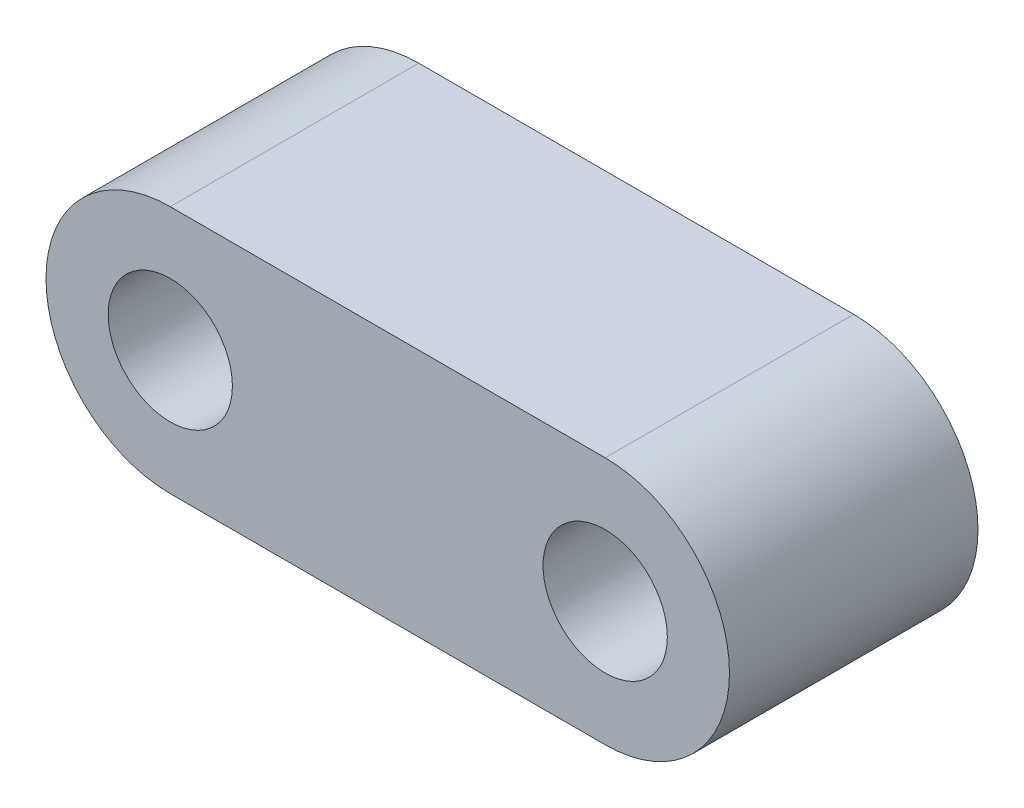
ISO-10303-21;
HEADER;
FILE_DESCRIPTION(('STEP AP214'),'2;1');
FILE_NAME('part.step','',(''),(''),'','','');
FILE_SCHEMA(('AUTOMOTIVE_DESIGN { 1 0 10303 214 1 1 1 1 }'));
ENDSEC;
DATA;
#1=APPLICATION_CONTEXT('core data for automotive mechanical design processes');
#2=APPLICATION_PROTOCOL_DEFINITION('international standard','automotive_design',2000,#1);
#3=PRODUCT_CONTEXT('',#1,'mechanical');
#4=PRODUCT('Part','Part','',(#3));
#5=PRODUCT_RELATED_PRODUCT_CATEGORY('part','',(#4));
#6=PRODUCT_DEFINITION_FORMATION('','',#4);
#7=PRODUCT_DEFINITION_CONTEXT('part definition',#1,'design');
#8=PRODUCT_DEFINITION('design','',#6,#7);
#9=PRODUCT_DEFINITION_SHAPE('','',#8);
#10=(LENGTH_UNIT() NAMED_UNIT(*) SI_UNIT(.MILLI.,.METRE.));
#11=(NAMED_UNIT(*) PLANE_ANGLE_UNIT() SI_UNIT($,.RADIAN.));
#12=(NAMED_UNIT(*) SI_UNIT($,.STERADIAN.) SOLID_ANGLE_UNIT());
#13=UNCERTAINTY_MEASURE_WITH_UNIT(LENGTH_MEASURE(1.E-05),#10,'distance_accuracy_value','');
#14=(GEOMETRIC_REPRESENTATION_CONTEXT(3) GLOBAL_UNCERTAINTY_ASSIGNED_CONTEXT((#13)) GLOBAL_UNIT_ASSIGNED_CONTEXT((#10,
#11,#12)) REPRESENTATION_CONTEXT('',''));
#15=CARTESIAN_POINT('',(0.,0.,0.));
#16=DIRECTION('',(0.,0.,1.));
#17=DIRECTION('',(1.,0.,0.));
#18=AXIS2_PLACEMENT_3D('',#15,#16,#17);
#19=CARTESIAN_POINT('',(0.,-20.,20.));
#20=DIRECTION('',(0.,-1.,0.));
#21=DIRECTION('',(0.,0.,-1.));
#22=AXIS2_PLACEMENT_3D('',#19,#20,#21);
#23=PLANE('',#22);
#24=DIRECTION('',(-1.,0.,0.));
#25=VECTOR('',#24,1.);
#26=CARTESIAN_POINT('',(0.,-20.,-20.));
#27=LINE('',#26,#25);
#28=CARTESIAN_POINT('',(70.,-20.,-20.));
#29=VERTEX_POINT('',#28);
#30=CARTESIAN_POINT('',(0.,-20.,-20.));
#31=VERTEX_POINT('',#30);
#32=EDGE_CURVE('E105',#29,#31,#27,.T.);
#33=ORIENTED_EDGE('',*,*,#32,.F.);
#34=DIRECTION('',(0.,0.,-1.));
#35=VECTOR('',#34,1.);
#36=CARTESIAN_POINT('',(70.,-20.,20.));
#37=LINE('',#36,#35);
#38=CARTESIAN_POINT('',(70.,-20.,20.));
#39=VERTEX_POINT('',#38);
#40=EDGE_CURVE('E11',#39,#29,#37,.T.);
#41=ORIENTED_EDGE('',*,*,#40,.F.);
#42=DIRECTION('',(-1.,0.,0.));
#43=VECTOR('',#42,1.);
#44=CARTESIAN_POINT('',(0.,-20.,20.));
#45=LINE('',#44,#43);
#46=CARTESIAN_POINT('',(0.,-20.,20.));
#47=VERTEX_POINT('',#46);
#48=EDGE_CURVE('E84',#39,#47,#45,.T.);
#49=ORIENTED_EDGE('',*,*,#48,.T.);
#50=DIRECTION('',(0.,0.,-1.));
#51=VECTOR('',#50,1.);
#52=CARTESIAN_POINT('',(0.,-20.,20.));
#53=LINE('',#52,#51);
#54=EDGE_CURVE('E73',#47,#31,#53,.T.);
#55=ORIENTED_EDGE('',*,*,#54,.T.);
#56=EDGE_LOOP('',(#33,#41,#49,#55));
#57=FACE_BOUND('',#56,.T.);
#58=ADVANCED_FACE('F35',(#57),#23,.T.);
#59=CARTESIAN_POINT('',(70.,0.,20.));
#60=DIRECTION('',(0.,0.,-1.));
#61=DIRECTION('',(-1.,0.,0.));
#62=AXIS2_PLACEMENT_3D('',#59,#60,#61);
#63=CYLINDRICAL_SURFACE('',#62,20.);
#64=CARTESIAN_POINT('',(70.,0.,-20.));
#65=DIRECTION('',(0.,0.,1.));
#66=DIRECTION('',(1.,0.,0.));
#67=AXIS2_PLACEMENT_3D('',#64,#65,#66);
#68=CIRCLE('',#67,20.);
#69=CARTESIAN_POINT('',(70.,20.,-20.));
#70=VERTEX_POINT('',#69);
#71=EDGE_CURVE('E90',#29,#70,#68,.T.);
#72=ORIENTED_EDGE('',*,*,#71,.T.);
#73=DIRECTION('',(0.,0.,-1.));
#74=VECTOR('',#73,1.);
#75=CARTESIAN_POINT('',(70.,20.,20.));
#76=LINE('',#75,#74);
#77=CARTESIAN_POINT('',(70.,20.,20.));
#78=VERTEX_POINT('',#77);
#79=EDGE_CURVE('E43',#78,#70,#76,.T.);
#80=ORIENTED_EDGE('',*,*,#79,.F.);
#81=CARTESIAN_POINT('',(70.,0.,20.));
#82=DIRECTION('',(0.,0.,1.));
#83=DIRECTION('',(1.,0.,0.));
#84=AXIS2_PLACEMENT_3D('',#81,#82,#83);
#85=CIRCLE('',#84,20.);
#86=EDGE_CURVE('E78',#39,#78,#85,.T.);
#87=ORIENTED_EDGE('',*,*,#86,.F.);
#88=ORIENTED_EDGE('',*,*,#40,.T.);
#89=EDGE_LOOP('',(#72,#80,#87,#88));
#90=FACE_BOUND('',#89,.T.);
#91=ADVANCED_FACE('F88',(#90),#63,.T.);
#92=CARTESIAN_POINT('',(0.,20.,20.));
#93=DIRECTION('',(0.,1.,0.));
#94=DIRECTION('',(0.,0.,1.));
#95=AXIS2_PLACEMENT_3D('',#92,#93,#94);
#96=PLANE('',#95);
#97=DIRECTION('',(1.,0.,0.));
#98=VECTOR('',#97,1.);
#99=CARTESIAN_POINT('',(0.,20.,-20.));
#100=LINE('',#99,#98);
#101=CARTESIAN_POINT('',(0.,20.,-20.));
#102=VERTEX_POINT('',#101);
#103=EDGE_CURVE('E109',#102,#70,#100,.T.);
#104=ORIENTED_EDGE('',*,*,#103,.F.);
#105=DIRECTION('',(0.,0.,-1.));
#106=VECTOR('',#105,1.);
#107=CARTESIAN_POINT('',(0.,20.,20.));
#108=LINE('',#107,#106);
#109=CARTESIAN_POINT('',(0.,20.,20.));
#110=VERTEX_POINT('',#109);
#111=EDGE_CURVE('E66',#110,#102,#108,.T.);
#112=ORIENTED_EDGE('',*,*,#111,.F.);
#113=DIRECTION('',(1.,0.,0.));
#114=VECTOR('',#113,1.);
#115=CARTESIAN_POINT('',(0.,20.,20.));
#116=LINE('',#115,#114);
#117=EDGE_CURVE('E83',#110,#78,#116,.T.);
#118=ORIENTED_EDGE('',*,*,#117,.T.);
#119=ORIENTED_EDGE('',*,*,#79,.T.);
#120=EDGE_LOOP('',(#104,#112,#118,#119));
#121=FACE_BOUND('',#120,.T.);
#122=ADVANCED_FACE('F94',(#121),#96,.T.);
#123=CARTESIAN_POINT('',(70.,0.,20.));
#124=DIRECTION('',(0.,0.,-1.));
#125=DIRECTION('',(-1.,0.,0.));
#126=AXIS2_PLACEMENT_3D('',#123,#124,#125);
#127=CYLINDRICAL_SURFACE('',#126,9.99999999999999);
#128=CARTESIAN_POINT('',(70.,0.,20.));
#129=DIRECTION('',(0.,0.,1.));
#130=DIRECTION('',(1.,0.,0.));
#131=AXIS2_PLACEMENT_3D('',#128,#129,#130);
#132=CIRCLE('',#131,9.99999999999999);
#133=CARTESIAN_POINT('',(80.,0.,20.));
#134=VERTEX_POINT('',#133);
#135=EDGE_CURVE('E96',#134,#134,#132,.T.);
#136=ORIENTED_EDGE('',*,*,#135,.T.);
#137=EDGE_LOOP('',(#136));
#138=FACE_BOUND('',#137,.T.);
#139=CARTESIAN_POINT('',(70.,0.,-20.));
#140=DIRECTION('',(0.,0.,1.));
#141=DIRECTION('',(1.,0.,0.));
#142=AXIS2_PLACEMENT_3D('',#139,#140,#141);
#143=CIRCLE('',#142,9.99999999999999);
#144=CARTESIAN_POINT('',(80.,0.,-20.));
#145=VERTEX_POINT('',#144);
#146=EDGE_CURVE('E113',#145,#145,#143,.T.);
#147=ORIENTED_EDGE('',*,*,#146,.F.);
#148=EDGE_LOOP('',(#147));
#149=FACE_BOUND('',#148,.T.);
#150=ADVANCED_FACE('F129',(#138,#149),#127,.F.);
#151=CARTESIAN_POINT('',(0.,0.,20.));
#152=DIRECTION('',(0.,0.,-1.));
#153=DIRECTION('',(-1.,0.,0.));
#154=AXIS2_PLACEMENT_3D('',#151,#152,#153);
#155=CYLINDRICAL_SURFACE('',#154,20.);
#156=CARTESIAN_POINT('',(0.,0.,-20.));
#157=DIRECTION('',(0.,0.,1.));
#158=DIRECTION('',(1.,0.,0.));
#159=AXIS2_PLACEMENT_3D('',#156,#157,#158);
#160=CIRCLE('',#159,20.);
#161=EDGE_CURVE('E111',#102,#31,#160,.T.);
#162=ORIENTED_EDGE('',*,*,#161,.T.);
#163=ORIENTED_EDGE('',*,*,#54,.F.);
#164=CARTESIAN_POINT('',(0.,0.,20.));
#165=DIRECTION('',(0.,0.,1.));
#166=DIRECTION('',(1.,0.,0.));
#167=AXIS2_PLACEMENT_3D('',#164,#165,#166);
#168=CIRCLE('',#167,20.);
#169=EDGE_CURVE('E51',#110,#47,#168,.T.);
#170=ORIENTED_EDGE('',*,*,#169,.F.);
#171=ORIENTED_EDGE('',*,*,#111,.T.);
#172=EDGE_LOOP('',(#162,#163,#170,#171));
#173=FACE_BOUND('',#172,.T.);
#174=ADVANCED_FACE('F132',(#173),#155,.T.);
#175=CARTESIAN_POINT('',(0.,0.,20.));
#176=DIRECTION('',(0.,0.,-1.));
#177=DIRECTION('',(-1.,0.,0.));
#178=AXIS2_PLACEMENT_3D('',#175,#176,#177);
#179=CYLINDRICAL_SURFACE('',#178,10.);
#180=CARTESIAN_POINT('',(0.,0.,20.));
#181=DIRECTION('',(0.,0.,1.));
#182=DIRECTION('',(1.,0.,0.));
#183=AXIS2_PLACEMENT_3D('',#180,#181,#182);
#184=CIRCLE('',#183,10.);
#185=CARTESIAN_POINT('',(10.,0.,20.));
#186=VERTEX_POINT('',#185);
#187=EDGE_CURVE('E102',#186,#186,#184,.T.);
#188=ORIENTED_EDGE('',*,*,#187,.T.);
#189=EDGE_LOOP('',(#188));
#190=FACE_BOUND('',#189,.T.);
#191=CARTESIAN_POINT('',(0.,0.,-20.));
#192=DIRECTION('',(0.,0.,1.));
#193=DIRECTION('',(1.,0.,0.));
#194=AXIS2_PLACEMENT_3D('',#191,#192,#193);
#195=CIRCLE('',#194,10.);
#196=CARTESIAN_POINT('',(10.,0.,-20.));
#197=VERTEX_POINT('',#196);
#198=EDGE_CURVE('E116',#197,#197,#195,.T.);
#199=ORIENTED_EDGE('',*,*,#198,.F.);
#200=EDGE_LOOP('',(#199));
#201=FACE_BOUND('',#200,.T.);
#202=ADVANCED_FACE('F135',(#190,#201),#179,.F.);
#203=CARTESIAN_POINT('',(0.,0.,20.));
#204=DIRECTION('',(0.,0.,1.));
#205=DIRECTION('',(1.,0.,0.));
#206=AXIS2_PLACEMENT_3D('',#203,#204,#205);
#207=PLANE('',#206);
#208=ORIENTED_EDGE('',*,*,#48,.F.);
#209=ORIENTED_EDGE('',*,*,#86,.T.);
#210=ORIENTED_EDGE('',*,*,#117,.F.);
#211=ORIENTED_EDGE('',*,*,#169,.T.);
#212=EDGE_LOOP('',(#208,#209,#210,#211));
#213=FACE_BOUND('',#212,.T.);
#214=ORIENTED_EDGE('',*,*,#135,.F.);
#215=EDGE_LOOP('',(#214));
#216=FACE_BOUND('',#215,.T.);
#217=ORIENTED_EDGE('',*,*,#187,.F.);
#218=EDGE_LOOP('',(#217));
#219=FACE_BOUND('',#218,.T.);
#220=ADVANCED_FACE('F80',(#213,#216,#219),#207,.T.);
#221=CARTESIAN_POINT('',(0.,0.,-20.));
#222=DIRECTION('',(0.,0.,1.));
#223=DIRECTION('',(1.,0.,0.));
#224=AXIS2_PLACEMENT_3D('',#221,#222,#223);
#225=PLANE('',#224);
#226=ORIENTED_EDGE('',*,*,#32,.T.);
#227=ORIENTED_EDGE('',*,*,#161,.F.);
#228=ORIENTED_EDGE('',*,*,#103,.T.);
#229=ORIENTED_EDGE('',*,*,#71,.F.);
#230=EDGE_LOOP('',(#226,#227,#228,#229));
#231=FACE_BOUND('',#230,.T.);
#232=ORIENTED_EDGE('',*,*,#146,.T.);
#233=EDGE_LOOP('',(#232));
#234=FACE_BOUND('',#233,.T.);
#235=ORIENTED_EDGE('',*,*,#198,.T.);
#236=EDGE_LOOP('',(#235));
#237=FACE_BOUND('',#236,.T.);
#238=ADVANCED_FACE('F142',(#231,#234,#237),#225,.F.);
#239=CLOSED_SHELL('',(#58,#91,#122,#150,#174,#202,#220,#238));
#240=MANIFOLD_SOLID_BREP('B2',#239);
#241=ADVANCED_BREP_SHAPE_REPRESENTATION('',(#18,#240),#14);
#242=SHAPE_DEFINITION_REPRESENTATION(#9,#241);
ENDSEC;
END-ISO-10303-21;
